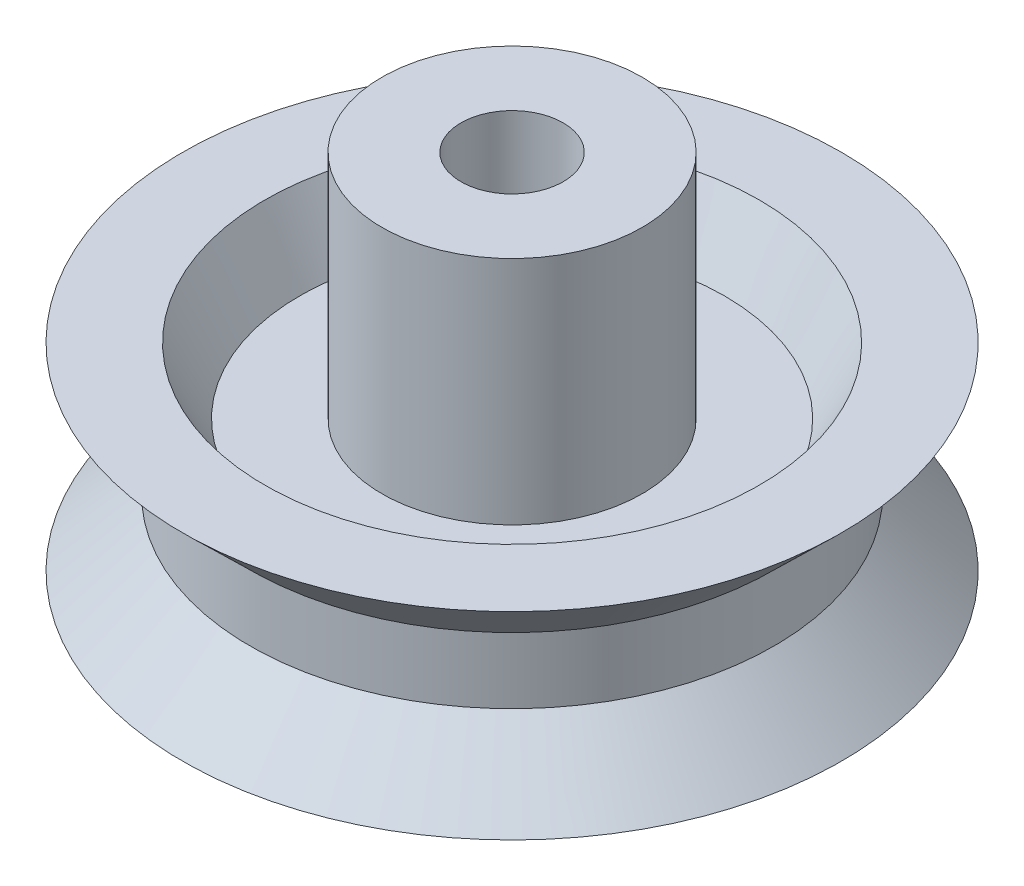
ISO-10303-21;
HEADER;
FILE_DESCRIPTION(('STEP AP214'),'2;1');
FILE_NAME('part.step','',(''),(''),'','','');
FILE_SCHEMA(('AUTOMOTIVE_DESIGN { 1 0 10303 214 1 1 1 1 }'));
ENDSEC;
DATA;
#1=APPLICATION_CONTEXT('core data for automotive mechanical design processes');
#2=APPLICATION_PROTOCOL_DEFINITION('international standard','automotive_design',2000,#1);
#3=PRODUCT_CONTEXT('',#1,'mechanical');
#4=PRODUCT('Part','Part','',(#3));
#5=PRODUCT_RELATED_PRODUCT_CATEGORY('part','',(#4));
#6=PRODUCT_DEFINITION_FORMATION('','',#4);
#7=PRODUCT_DEFINITION_CONTEXT('part definition',#1,'design');
#8=PRODUCT_DEFINITION('design','',#6,#7);
#9=PRODUCT_DEFINITION_SHAPE('','',#8);
#10=(LENGTH_UNIT() NAMED_UNIT(*) SI_UNIT(.MILLI.,.METRE.));
#11=(NAMED_UNIT(*) PLANE_ANGLE_UNIT() SI_UNIT($,.RADIAN.));
#12=(NAMED_UNIT(*) SI_UNIT($,.STERADIAN.) SOLID_ANGLE_UNIT());
#13=UNCERTAINTY_MEASURE_WITH_UNIT(LENGTH_MEASURE(1.E-05),#10,'distance_accuracy_value','');
#14=(GEOMETRIC_REPRESENTATION_CONTEXT(3) GLOBAL_UNCERTAINTY_ASSIGNED_CONTEXT((#13)) GLOBAL_UNIT_ASSIGNED_CONTEXT((#10,
#11,#12)) REPRESENTATION_CONTEXT('',''));
#15=CARTESIAN_POINT('',(0.,0.,0.));
#16=DIRECTION('',(0.,0.,1.));
#17=DIRECTION('',(1.,0.,0.));
#18=AXIS2_PLACEMENT_3D('',#15,#16,#17);
#19=CARTESIAN_POINT('',(0.,-10.3546306504961,0.));
#20=DIRECTION('',(0.,-1.,0.));
#21=DIRECTION('',(0.,0.,-1.));
#22=AXIS2_PLACEMENT_3D('',#19,#20,#21);
#23=CYLINDRICAL_SURFACE('',#22,1.55);
#24=CARTESIAN_POINT('',(0.,0.,0.));
#25=DIRECTION('',(0.,-1.,0.));
#26=DIRECTION('',(0.,0.,-1.));
#27=AXIS2_PLACEMENT_3D('',#24,#25,#26);
#28=CIRCLE('',#27,1.55);
#29=CARTESIAN_POINT('',(0.,0.,-1.55));
#30=VERTEX_POINT('',#29);
#31=EDGE_CURVE('E10',#30,#30,#28,.T.);
#32=ORIENTED_EDGE('',*,*,#31,.T.);
#33=EDGE_LOOP('',(#32));
#34=FACE_BOUND('',#33,.T.);
#35=CARTESIAN_POINT('',(0.,11.,0.));
#36=DIRECTION('',(0.,-1.,0.));
#37=DIRECTION('',(0.,0.,-1.));
#38=AXIS2_PLACEMENT_3D('',#35,#36,#37);
#39=CIRCLE('',#38,1.55);
#40=CARTESIAN_POINT('',(0.,11.,-1.55));
#41=VERTEX_POINT('',#40);
#42=EDGE_CURVE('E76',#41,#41,#39,.T.);
#43=ORIENTED_EDGE('',*,*,#42,.F.);
#44=EDGE_LOOP('',(#43));
#45=FACE_BOUND('',#44,.T.);
#46=ADVANCED_FACE('F30',(#34,#45),#23,.F.);
#47=CARTESIAN_POINT('',(0.,0.,-1.55));
#48=DIRECTION('',(0.,-1.,0.));
#49=DIRECTION('',(0.,0.,-1.));
#50=AXIS2_PLACEMENT_3D('',#47,#48,#49);
#51=PLANE('',#50);
#52=CARTESIAN_POINT('',(0.,0.,0.));
#53=DIRECTION('',(0.,-1.,0.));
#54=DIRECTION('',(0.,0.,-1.));
#55=AXIS2_PLACEMENT_3D('',#52,#53,#54);
#56=CIRCLE('',#55,3.95);
#57=CARTESIAN_POINT('',(0.,0.,-3.95));
#58=VERTEX_POINT('',#57);
#59=EDGE_CURVE('E36',#58,#58,#56,.T.);
#60=ORIENTED_EDGE('',*,*,#59,.T.);
#61=EDGE_LOOP('',(#60));
#62=FACE_BOUND('',#61,.T.);
#63=ORIENTED_EDGE('',*,*,#31,.F.);
#64=EDGE_LOOP('',(#63));
#65=FACE_BOUND('',#64,.T.);
#66=ADVANCED_FACE('F84',(#62,#65),#51,.T.);
#67=CARTESIAN_POINT('',(0.,-10.3546306504961,0.));
#68=DIRECTION('',(0.,-1.,0.));
#69=DIRECTION('',(0.,0.,-1.));
#70=AXIS2_PLACEMENT_3D('',#67,#68,#69);
#71=CYLINDRICAL_SURFACE('',#70,3.95);
#72=CARTESIAN_POINT('',(0.,2.,0.));
#73=DIRECTION('',(0.,-1.,0.));
#74=DIRECTION('',(0.,0.,-1.));
#75=AXIS2_PLACEMENT_3D('',#72,#73,#74);
#76=CIRCLE('',#75,3.95);
#77=CARTESIAN_POINT('',(0.,2.,-3.95));
#78=VERTEX_POINT('',#77);
#79=EDGE_CURVE('E40',#78,#78,#76,.T.);
#80=ORIENTED_EDGE('',*,*,#79,.T.);
#81=EDGE_LOOP('',(#80));
#82=FACE_BOUND('',#81,.T.);
#83=ORIENTED_EDGE('',*,*,#59,.F.);
#84=EDGE_LOOP('',(#83));
#85=FACE_BOUND('',#84,.T.);
#86=ADVANCED_FACE('F88',(#82,#85),#71,.T.);
#87=CARTESIAN_POINT('',(0.,2.,-3.95));
#88=DIRECTION('',(0.,-1.,0.));
#89=DIRECTION('',(0.,0.,-1.));
#90=AXIS2_PLACEMENT_3D('',#87,#88,#89);
#91=PLANE('',#90);
#92=CARTESIAN_POINT('',(0.,2.,0.));
#93=DIRECTION('',(0.,-1.,0.));
#94=DIRECTION('',(0.,0.,-1.));
#95=AXIS2_PLACEMENT_3D('',#92,#93,#94);
#96=CIRCLE('',#95,6.45);
#97=CARTESIAN_POINT('',(0.,2.,-6.45));
#98=VERTEX_POINT('',#97);
#99=EDGE_CURVE('E44',#98,#98,#96,.T.);
#100=ORIENTED_EDGE('',*,*,#99,.T.);
#101=EDGE_LOOP('',(#100));
#102=FACE_BOUND('',#101,.T.);
#103=ORIENTED_EDGE('',*,*,#79,.F.);
#104=EDGE_LOOP('',(#103));
#105=FACE_BOUND('',#104,.T.);
#106=ADVANCED_FACE('F92',(#102,#105),#91,.T.);
#107=CARTESIAN_POINT('',(0.,2.,0.));
#108=DIRECTION('',(0.,-1.,0.));
#109=DIRECTION('',(0.,0.,-1.));
#110=AXIS2_PLACEMENT_3D('',#107,#108,#109);
#111=CONICAL_SURFACE('',#110,6.45,0.483447001567199);
#112=CARTESIAN_POINT('',(0.,0.,0.));
#113=DIRECTION('',(0.,-1.,0.));
#114=DIRECTION('',(0.,0.,-1.));
#115=AXIS2_PLACEMENT_3D('',#112,#113,#114);
#116=CIRCLE('',#115,7.5);
#117=CARTESIAN_POINT('',(0.,0.,-7.5));
#118=VERTEX_POINT('',#117);
#119=EDGE_CURVE('E49',#118,#118,#116,.T.);
#120=ORIENTED_EDGE('',*,*,#119,.T.);
#121=EDGE_LOOP('',(#120));
#122=FACE_BOUND('',#121,.T.);
#123=ORIENTED_EDGE('',*,*,#99,.F.);
#124=EDGE_LOOP('',(#123));
#125=FACE_BOUND('',#124,.T.);
#126=ADVANCED_FACE('F99',(#122,#125),#111,.F.);
#127=CARTESIAN_POINT('',(0.,0.,-7.5));
#128=DIRECTION('',(0.,-1.,0.));
#129=DIRECTION('',(0.,0.,-1.));
#130=AXIS2_PLACEMENT_3D('',#127,#128,#129);
#131=PLANE('',#130);
#132=CARTESIAN_POINT('',(0.,0.,0.));
#133=DIRECTION('',(0.,-1.,0.));
#134=DIRECTION('',(0.,0.,-1.));
#135=AXIS2_PLACEMENT_3D('',#132,#133,#134);
#136=CIRCLE('',#135,10.);
#137=CARTESIAN_POINT('',(0.,0.,-10.));
#138=VERTEX_POINT('',#137);
#139=EDGE_CURVE('E52',#138,#138,#136,.T.);
#140=ORIENTED_EDGE('',*,*,#139,.T.);
#141=EDGE_LOOP('',(#140));
#142=FACE_BOUND('',#141,.T.);
#143=ORIENTED_EDGE('',*,*,#119,.F.);
#144=EDGE_LOOP('',(#143));
#145=FACE_BOUND('',#144,.T.);
#146=ADVANCED_FACE('F103',(#142,#145),#131,.T.);
#147=CARTESIAN_POINT('',(0.,0.,0.));
#148=DIRECTION('',(0.,-1.,0.));
#149=DIRECTION('',(0.,0.,-1.));
#150=AXIS2_PLACEMENT_3D('',#147,#148,#149);
#151=CONICAL_SURFACE('',#150,10.,0.797743215241672);
#152=CARTESIAN_POINT('',(0.,2.,0.));
#153=DIRECTION('',(0.,-1.,0.));
#154=DIRECTION('',(0.,0.,-1.));
#155=AXIS2_PLACEMENT_3D('',#152,#153,#154);
#156=CIRCLE('',#155,7.95);
#157=CARTESIAN_POINT('',(0.,2.,-7.95));
#158=VERTEX_POINT('',#157);
#159=EDGE_CURVE('E55',#158,#158,#156,.T.);
#160=ORIENTED_EDGE('',*,*,#159,.T.);
#161=EDGE_LOOP('',(#160));
#162=FACE_BOUND('',#161,.T.);
#163=ORIENTED_EDGE('',*,*,#139,.F.);
#164=EDGE_LOOP('',(#163));
#165=FACE_BOUND('',#164,.T.);
#166=ADVANCED_FACE('F107',(#162,#165),#151,.T.);
#167=CARTESIAN_POINT('',(0.,-10.3546306504961,0.));
#168=DIRECTION('',(0.,-1.,0.));
#169=DIRECTION('',(0.,0.,-1.));
#170=AXIS2_PLACEMENT_3D('',#167,#168,#169);
#171=CYLINDRICAL_SURFACE('',#170,7.95);
#172=CARTESIAN_POINT('',(0.,4.,0.));
#173=DIRECTION('',(0.,-1.,0.));
#174=DIRECTION('',(0.,0.,-1.));
#175=AXIS2_PLACEMENT_3D('',#172,#173,#174);
#176=CIRCLE('',#175,7.95);
#177=CARTESIAN_POINT('',(0.,4.,-7.95));
#178=VERTEX_POINT('',#177);
#179=EDGE_CURVE('E58',#178,#178,#176,.T.);
#180=ORIENTED_EDGE('',*,*,#179,.T.);
#181=EDGE_LOOP('',(#180));
#182=FACE_BOUND('',#181,.T.);
#183=ORIENTED_EDGE('',*,*,#159,.F.);
#184=EDGE_LOOP('',(#183));
#185=FACE_BOUND('',#184,.T.);
#186=ADVANCED_FACE('F111',(#182,#185),#171,.T.);
#187=CARTESIAN_POINT('',(0.,4.,0.));
#188=DIRECTION('',(0.,1.,0.));
#189=DIRECTION('',(0.,0.,1.));
#190=AXIS2_PLACEMENT_3D('',#187,#188,#189);
#191=CONICAL_SURFACE('',#190,7.95,0.797743215241673);
#192=CARTESIAN_POINT('',(0.,6.,0.));
#193=DIRECTION('',(0.,-1.,0.));
#194=DIRECTION('',(0.,0.,-1.));
#195=AXIS2_PLACEMENT_3D('',#192,#193,#194);
#196=CIRCLE('',#195,10.);
#197=CARTESIAN_POINT('',(0.,6.,-10.));
#198=VERTEX_POINT('',#197);
#199=EDGE_CURVE('E61',#198,#198,#196,.T.);
#200=ORIENTED_EDGE('',*,*,#199,.T.);
#201=EDGE_LOOP('',(#200));
#202=FACE_BOUND('',#201,.T.);
#203=ORIENTED_EDGE('',*,*,#179,.F.);
#204=EDGE_LOOP('',(#203));
#205=FACE_BOUND('',#204,.T.);
#206=ADVANCED_FACE('F115',(#202,#205),#191,.T.);
#207=CARTESIAN_POINT('',(0.,6.,-10.));
#208=DIRECTION('',(0.,1.,0.));
#209=DIRECTION('',(0.,0.,1.));
#210=AXIS2_PLACEMENT_3D('',#207,#208,#209);
#211=PLANE('',#210);
#212=CARTESIAN_POINT('',(0.,6.,0.));
#213=DIRECTION('',(0.,-1.,0.));
#214=DIRECTION('',(0.,0.,-1.));
#215=AXIS2_PLACEMENT_3D('',#212,#213,#214);
#216=CIRCLE('',#215,7.5);
#217=CARTESIAN_POINT('',(0.,6.,-7.5));
#218=VERTEX_POINT('',#217);
#219=EDGE_CURVE('E64',#218,#218,#216,.T.);
#220=ORIENTED_EDGE('',*,*,#219,.T.);
#221=EDGE_LOOP('',(#220));
#222=FACE_BOUND('',#221,.T.);
#223=ORIENTED_EDGE('',*,*,#199,.F.);
#224=EDGE_LOOP('',(#223));
#225=FACE_BOUND('',#224,.T.);
#226=ADVANCED_FACE('F119',(#222,#225),#211,.T.);
#227=CARTESIAN_POINT('',(0.,6.,0.));
#228=DIRECTION('',(0.,1.,0.));
#229=DIRECTION('',(0.,0.,1.));
#230=AXIS2_PLACEMENT_3D('',#227,#228,#229);
#231=CONICAL_SURFACE('',#230,7.5,0.483447001567198);
#232=CARTESIAN_POINT('',(0.,4.,0.));
#233=DIRECTION('',(0.,-1.,0.));
#234=DIRECTION('',(0.,0.,-1.));
#235=AXIS2_PLACEMENT_3D('',#232,#233,#234);
#236=CIRCLE('',#235,6.45);
#237=CARTESIAN_POINT('',(0.,4.,-6.45));
#238=VERTEX_POINT('',#237);
#239=EDGE_CURVE('E67',#238,#238,#236,.T.);
#240=ORIENTED_EDGE('',*,*,#239,.T.);
#241=EDGE_LOOP('',(#240));
#242=FACE_BOUND('',#241,.T.);
#243=ORIENTED_EDGE('',*,*,#219,.F.);
#244=EDGE_LOOP('',(#243));
#245=FACE_BOUND('',#244,.T.);
#246=ADVANCED_FACE('F123',(#242,#245),#231,.F.);
#247=CARTESIAN_POINT('',(0.,4.,-6.45));
#248=DIRECTION('',(0.,1.,0.));
#249=DIRECTION('',(0.,0.,1.));
#250=AXIS2_PLACEMENT_3D('',#247,#248,#249);
#251=PLANE('',#250);
#252=CARTESIAN_POINT('',(0.,4.,0.));
#253=DIRECTION('',(0.,-1.,0.));
#254=DIRECTION('',(0.,0.,-1.));
#255=AXIS2_PLACEMENT_3D('',#252,#253,#254);
#256=CIRCLE('',#255,3.95);
#257=CARTESIAN_POINT('',(0.,4.,-3.95));
#258=VERTEX_POINT('',#257);
#259=EDGE_CURVE('E70',#258,#258,#256,.T.);
#260=ORIENTED_EDGE('',*,*,#259,.T.);
#261=EDGE_LOOP('',(#260));
#262=FACE_BOUND('',#261,.T.);
#263=ORIENTED_EDGE('',*,*,#239,.F.);
#264=EDGE_LOOP('',(#263));
#265=FACE_BOUND('',#264,.T.);
#266=ADVANCED_FACE('F127',(#262,#265),#251,.T.);
#267=CARTESIAN_POINT('',(0.,-10.3546306504961,0.));
#268=DIRECTION('',(0.,-1.,0.));
#269=DIRECTION('',(0.,0.,-1.));
#270=AXIS2_PLACEMENT_3D('',#267,#268,#269);
#271=CYLINDRICAL_SURFACE('',#270,3.95);
#272=CARTESIAN_POINT('',(0.,11.,0.));
#273=DIRECTION('',(0.,-1.,0.));
#274=DIRECTION('',(0.,0.,-1.));
#275=AXIS2_PLACEMENT_3D('',#272,#273,#274);
#276=CIRCLE('',#275,3.95);
#277=CARTESIAN_POINT('',(0.,11.,-3.95));
#278=VERTEX_POINT('',#277);
#279=EDGE_CURVE('E73',#278,#278,#276,.T.);
#280=ORIENTED_EDGE('',*,*,#279,.T.);
#281=EDGE_LOOP('',(#280));
#282=FACE_BOUND('',#281,.T.);
#283=ORIENTED_EDGE('',*,*,#259,.F.);
#284=EDGE_LOOP('',(#283));
#285=FACE_BOUND('',#284,.T.);
#286=ADVANCED_FACE('F131',(#282,#285),#271,.T.);
#287=CARTESIAN_POINT('',(0.,11.,-3.95));
#288=DIRECTION('',(0.,1.,0.));
#289=DIRECTION('',(0.,0.,1.));
#290=AXIS2_PLACEMENT_3D('',#287,#288,#289);
#291=PLANE('',#290);
#292=ORIENTED_EDGE('',*,*,#42,.T.);
#293=EDGE_LOOP('',(#292));
#294=FACE_BOUND('',#293,.T.);
#295=ORIENTED_EDGE('',*,*,#279,.F.);
#296=EDGE_LOOP('',(#295));
#297=FACE_BOUND('',#296,.T.);
#298=ADVANCED_FACE('F80',(#294,#297),#291,.T.);
#299=CLOSED_SHELL('',(#46,#66,#86,#106,#126,#146,#166,#186,#206,#226,#246,#266,#286,#298));
#300=MANIFOLD_SOLID_BREP('B2',#299);
#301=ADVANCED_BREP_SHAPE_REPRESENTATION('',(#18,#300),#14);
#302=SHAPE_DEFINITION_REPRESENTATION(#9,#301);
ENDSEC;
END-ISO-10303-21;
